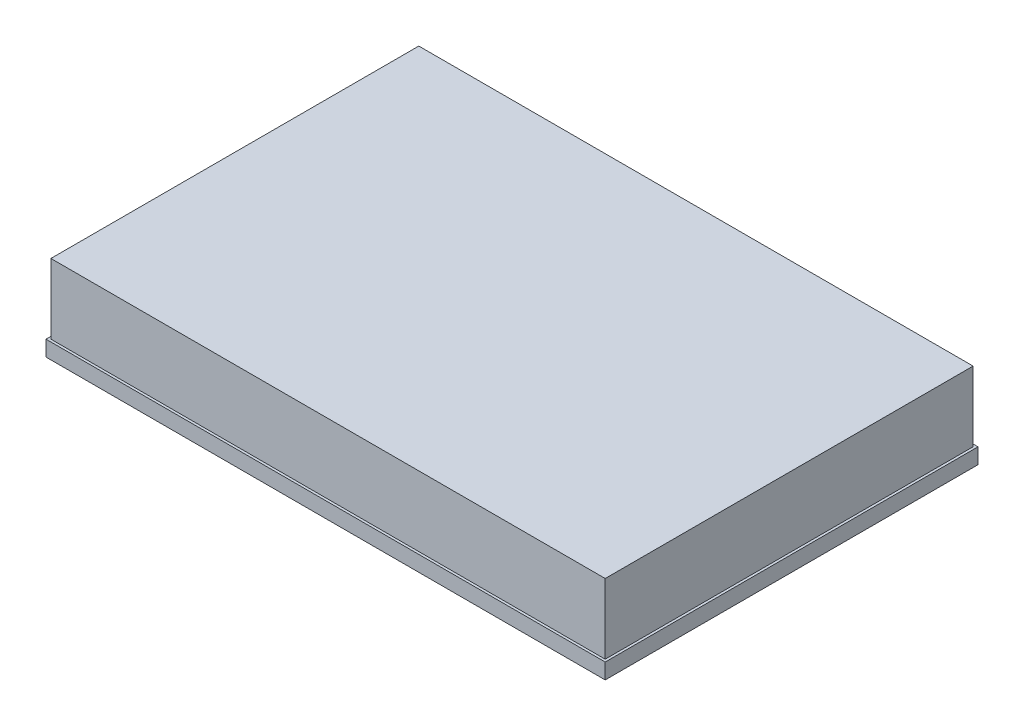
ISO-10303-21;
HEADER;
FILE_DESCRIPTION(('STEP AP214'),'2;1');
FILE_NAME('part.step','',(''),(''),'','','');
FILE_SCHEMA(('AUTOMOTIVE_DESIGN { 1 0 10303 214 1 1 1 1 }'));
ENDSEC;
DATA;
#1=APPLICATION_CONTEXT('core data for automotive mechanical design processes');
#2=APPLICATION_PROTOCOL_DEFINITION('international standard','automotive_design',2000,#1);
#3=PRODUCT_CONTEXT('',#1,'mechanical');
#4=PRODUCT('Part','Part','',(#3));
#5=PRODUCT_RELATED_PRODUCT_CATEGORY('part','',(#4));
#6=PRODUCT_DEFINITION_FORMATION('','',#4);
#7=PRODUCT_DEFINITION_CONTEXT('part definition',#1,'design');
#8=PRODUCT_DEFINITION('design','',#6,#7);
#9=PRODUCT_DEFINITION_SHAPE('','',#8);
#10=(LENGTH_UNIT() NAMED_UNIT(*) SI_UNIT(.MILLI.,.METRE.));
#11=(NAMED_UNIT(*) PLANE_ANGLE_UNIT() SI_UNIT($,.RADIAN.));
#12=(NAMED_UNIT(*) SI_UNIT($,.STERADIAN.) SOLID_ANGLE_UNIT());
#13=UNCERTAINTY_MEASURE_WITH_UNIT(LENGTH_MEASURE(1.E-05),#10,'distance_accuracy_value','');
#14=(GEOMETRIC_REPRESENTATION_CONTEXT(3) GLOBAL_UNCERTAINTY_ASSIGNED_CONTEXT((#13)) GLOBAL_UNIT_ASSIGNED_CONTEXT((#10,
#11,#12)) REPRESENTATION_CONTEXT('',''));
#15=CARTESIAN_POINT('',(0.,0.,0.));
#16=DIRECTION('',(0.,0.,1.));
#17=DIRECTION('',(1.,0.,0.));
#18=AXIS2_PLACEMENT_3D('',#15,#16,#17);
#19=CARTESIAN_POINT('',(0.,3.175,0.));
#20=DIRECTION('',(0.,1.,0.));
#21=DIRECTION('',(0.,0.,1.));
#22=AXIS2_PLACEMENT_3D('',#19,#20,#21);
#23=PLANE('',#22);
#24=DIRECTION('',(0.,0.,-1.));
#25=VECTOR('',#24,1.);
#26=CARTESIAN_POINT('',(0.,3.175,0.));
#27=LINE('',#26,#25);
#28=CARTESIAN_POINT('',(0.,3.175,0.));
#29=VERTEX_POINT('',#28);
#30=CARTESIAN_POINT('',(0.,3.175,-76.2));
#31=VERTEX_POINT('',#30);
#32=EDGE_CURVE('E149',#29,#31,#27,.T.);
#33=ORIENTED_EDGE('',*,*,#32,.T.);
#34=DIRECTION('',(-1.,0.,0.));
#35=VECTOR('',#34,1.);
#36=CARTESIAN_POINT('',(0.,3.175,-76.2));
#37=LINE('',#36,#35);
#38=CARTESIAN_POINT('',(-114.3,3.175,-76.2));
#39=VERTEX_POINT('',#38);
#40=EDGE_CURVE('E87',#31,#39,#37,.T.);
#41=ORIENTED_EDGE('',*,*,#40,.T.);
#42=DIRECTION('',(0.,0.,1.));
#43=VECTOR('',#42,1.);
#44=CARTESIAN_POINT('',(-114.3,3.175,0.));
#45=LINE('',#44,#43);
#46=CARTESIAN_POINT('',(-114.3,3.175,0.));
#47=VERTEX_POINT('',#46);
#48=EDGE_CURVE('E152',#39,#47,#45,.T.);
#49=ORIENTED_EDGE('',*,*,#48,.T.);
#50=DIRECTION('',(1.,0.,0.));
#51=VECTOR('',#50,1.);
#52=CARTESIAN_POINT('',(0.,3.175,0.));
#53=LINE('',#52,#51);
#54=EDGE_CURVE('E59',#47,#29,#53,.T.);
#55=ORIENTED_EDGE('',*,*,#54,.T.);
#56=EDGE_LOOP('',(#33,#41,#49,#55));
#57=FACE_BOUND('',#56,.T.);
#58=DIRECTION('',(-1.,0.,0.));
#59=VECTOR('',#58,1.);
#60=CARTESIAN_POINT('',(-0.5,3.175,-75.7));
#61=LINE('',#60,#59);
#62=CARTESIAN_POINT('',(-0.5,3.175,-75.7));
#63=VERTEX_POINT('',#62);
#64=CARTESIAN_POINT('',(-113.8,3.175,-75.7));
#65=VERTEX_POINT('',#64);
#66=EDGE_CURVE('E141',#63,#65,#61,.T.);
#67=ORIENTED_EDGE('',*,*,#66,.F.);
#68=DIRECTION('',(0.,0.,-1.));
#69=VECTOR('',#68,1.);
#70=CARTESIAN_POINT('',(-0.5,3.175,-14.0346711477281));
#71=LINE('',#70,#69);
#72=CARTESIAN_POINT('',(-0.5,3.175,-0.5));
#73=VERTEX_POINT('',#72);
#74=EDGE_CURVE('E125',#73,#63,#71,.T.);
#75=ORIENTED_EDGE('',*,*,#74,.F.);
#76=DIRECTION('',(1.,0.,0.));
#77=VECTOR('',#76,1.);
#78=CARTESIAN_POINT('',(-113.8,3.175,-0.5));
#79=LINE('',#78,#77);
#80=CARTESIAN_POINT('',(-113.8,3.175,-0.5));
#81=VERTEX_POINT('',#80);
#82=EDGE_CURVE('E119',#81,#73,#79,.T.);
#83=ORIENTED_EDGE('',*,*,#82,.F.);
#84=DIRECTION('',(0.,0.,1.));
#85=VECTOR('',#84,1.);
#86=CARTESIAN_POINT('',(-113.8,3.175,-75.7));
#87=LINE('',#86,#85);
#88=EDGE_CURVE('E143',#65,#81,#87,.T.);
#89=ORIENTED_EDGE('',*,*,#88,.F.);
#90=EDGE_LOOP('',(#67,#75,#83,#89));
#91=FACE_BOUND('',#90,.T.);
#92=ADVANCED_FACE('F35',(#57,#91),#23,.T.);
#93=CARTESIAN_POINT('',(0.,3.175,0.));
#94=DIRECTION('',(-1.,0.,0.));
#95=DIRECTION('',(0.,0.,1.));
#96=AXIS2_PLACEMENT_3D('',#93,#94,#95);
#97=PLANE('',#96);
#98=DIRECTION('',(0.,0.,-1.));
#99=VECTOR('',#98,1.);
#100=CARTESIAN_POINT('',(0.,0.,0.));
#101=LINE('',#100,#99);
#102=CARTESIAN_POINT('',(0.,0.,0.));
#103=VERTEX_POINT('',#102);
#104=CARTESIAN_POINT('',(0.,0.,-76.2));
#105=VERTEX_POINT('',#104);
#106=EDGE_CURVE('E128',#103,#105,#101,.T.);
#107=ORIENTED_EDGE('',*,*,#106,.T.);
#108=DIRECTION('',(0.,-1.,0.));
#109=VECTOR('',#108,1.);
#110=CARTESIAN_POINT('',(0.,3.175,-76.2));
#111=LINE('',#110,#109);
#112=EDGE_CURVE('E11',#31,#105,#111,.T.);
#113=ORIENTED_EDGE('',*,*,#112,.F.);
#114=ORIENTED_EDGE('',*,*,#32,.F.);
#115=DIRECTION('',(0.,-1.,0.));
#116=VECTOR('',#115,1.);
#117=CARTESIAN_POINT('',(0.,3.175,0.));
#118=LINE('',#117,#116);
#119=EDGE_CURVE('E155',#29,#103,#118,.T.);
#120=ORIENTED_EDGE('',*,*,#119,.T.);
#121=EDGE_LOOP('',(#107,#113,#114,#120));
#122=FACE_BOUND('',#121,.T.);
#123=ADVANCED_FACE('F37',(#122),#97,.F.);
#124=CARTESIAN_POINT('',(0.,3.175,-76.2));
#125=DIRECTION('',(0.,0.,1.));
#126=DIRECTION('',(1.,0.,0.));
#127=AXIS2_PLACEMENT_3D('',#124,#125,#126);
#128=PLANE('',#127);
#129=DIRECTION('',(-1.,0.,0.));
#130=VECTOR('',#129,1.);
#131=CARTESIAN_POINT('',(0.,0.,-76.2));
#132=LINE('',#131,#130);
#133=CARTESIAN_POINT('',(-114.3,0.,-76.2));
#134=VERTEX_POINT('',#133);
#135=EDGE_CURVE('E158',#105,#134,#132,.T.);
#136=ORIENTED_EDGE('',*,*,#135,.T.);
#137=DIRECTION('',(0.,-1.,0.));
#138=VECTOR('',#137,1.);
#139=CARTESIAN_POINT('',(-114.3,3.175,-76.2));
#140=LINE('',#139,#138);
#141=EDGE_CURVE('E43',#39,#134,#140,.T.);
#142=ORIENTED_EDGE('',*,*,#141,.F.);
#143=ORIENTED_EDGE('',*,*,#40,.F.);
#144=ORIENTED_EDGE('',*,*,#112,.T.);
#145=EDGE_LOOP('',(#136,#142,#143,#144));
#146=FACE_BOUND('',#145,.T.);
#147=ADVANCED_FACE('F185',(#146),#128,.F.);
#148=CARTESIAN_POINT('',(-114.3,3.175,0.));
#149=DIRECTION('',(1.,0.,0.));
#150=DIRECTION('',(0.,0.,-1.));
#151=AXIS2_PLACEMENT_3D('',#148,#149,#150);
#152=PLANE('',#151);
#153=DIRECTION('',(0.,0.,1.));
#154=VECTOR('',#153,1.);
#155=CARTESIAN_POINT('',(-114.3,0.,0.));
#156=LINE('',#155,#154);
#157=CARTESIAN_POINT('',(-114.3,0.,0.));
#158=VERTEX_POINT('',#157);
#159=EDGE_CURVE('E160',#134,#158,#156,.T.);
#160=ORIENTED_EDGE('',*,*,#159,.T.);
#161=DIRECTION('',(0.,-1.,0.));
#162=VECTOR('',#161,1.);
#163=CARTESIAN_POINT('',(-114.3,3.175,0.));
#164=LINE('',#163,#162);
#165=EDGE_CURVE('E164',#47,#158,#164,.T.);
#166=ORIENTED_EDGE('',*,*,#165,.F.);
#167=ORIENTED_EDGE('',*,*,#48,.F.);
#168=ORIENTED_EDGE('',*,*,#141,.T.);
#169=EDGE_LOOP('',(#160,#166,#167,#168));
#170=FACE_BOUND('',#169,.T.);
#171=ADVANCED_FACE('F169',(#170),#152,.F.);
#172=CARTESIAN_POINT('',(0.,3.175,0.));
#173=DIRECTION('',(0.,0.,-1.));
#174=DIRECTION('',(-1.,0.,0.));
#175=AXIS2_PLACEMENT_3D('',#172,#173,#174);
#176=PLANE('',#175);
#177=DIRECTION('',(1.,0.,0.));
#178=VECTOR('',#177,1.);
#179=CARTESIAN_POINT('',(0.,0.,0.));
#180=LINE('',#179,#178);
#181=EDGE_CURVE('E80',#158,#103,#180,.T.);
#182=ORIENTED_EDGE('',*,*,#181,.T.);
#183=ORIENTED_EDGE('',*,*,#119,.F.);
#184=ORIENTED_EDGE('',*,*,#54,.F.);
#185=ORIENTED_EDGE('',*,*,#165,.T.);
#186=EDGE_LOOP('',(#182,#183,#184,#185));
#187=FACE_BOUND('',#186,.T.);
#188=ADVANCED_FACE('F177',(#187),#176,.F.);
#189=CARTESIAN_POINT('',(0.,0.,0.));
#190=DIRECTION('',(0.,1.,0.));
#191=DIRECTION('',(0.,0.,1.));
#192=AXIS2_PLACEMENT_3D('',#189,#190,#191);
#193=PLANE('',#192);
#194=ORIENTED_EDGE('',*,*,#106,.F.);
#195=ORIENTED_EDGE('',*,*,#181,.F.);
#196=ORIENTED_EDGE('',*,*,#159,.F.);
#197=ORIENTED_EDGE('',*,*,#135,.F.);
#198=EDGE_LOOP('',(#194,#195,#196,#197));
#199=FACE_BOUND('',#198,.T.);
#200=ADVANCED_FACE('F173',(#199),#193,.F.);
#201=CARTESIAN_POINT('',(-0.5,17.4625,-14.0346711477281));
#202=DIRECTION('',(-1.,0.,0.));
#203=DIRECTION('',(0.,0.,1.));
#204=AXIS2_PLACEMENT_3D('',#201,#202,#203);
#205=PLANE('',#204);
#206=ORIENTED_EDGE('',*,*,#74,.T.);
#207=DIRECTION('',(0.,-1.,0.));
#208=VECTOR('',#207,1.);
#209=CARTESIAN_POINT('',(-0.5,17.4625,-75.7));
#210=LINE('',#209,#208);
#211=CARTESIAN_POINT('',(-0.5,17.4625,-75.7));
#212=VERTEX_POINT('',#211);
#213=EDGE_CURVE('E122',#212,#63,#210,.T.);
#214=ORIENTED_EDGE('',*,*,#213,.F.);
#215=DIRECTION('',(0.,0.,-1.));
#216=VECTOR('',#215,1.);
#217=CARTESIAN_POINT('',(-0.5,17.4625,-0.5));
#218=LINE('',#217,#216);
#219=CARTESIAN_POINT('',(-0.5,17.4625,-0.5));
#220=VERTEX_POINT('',#219);
#221=EDGE_CURVE('E109',#220,#212,#218,.T.);
#222=ORIENTED_EDGE('',*,*,#221,.F.);
#223=DIRECTION('',(0.,-1.,0.));
#224=VECTOR('',#223,1.);
#225=CARTESIAN_POINT('',(-0.5,17.4625,-0.5));
#226=LINE('',#225,#224);
#227=EDGE_CURVE('E139',#220,#73,#226,.T.);
#228=ORIENTED_EDGE('',*,*,#227,.T.);
#229=EDGE_LOOP('',(#206,#214,#222,#228));
#230=FACE_BOUND('',#229,.T.);
#231=ADVANCED_FACE('F123',(#230),#205,.F.);
#232=CARTESIAN_POINT('',(-0.5,17.4625,-75.7));
#233=DIRECTION('',(0.,0.,1.));
#234=DIRECTION('',(1.,0.,0.));
#235=AXIS2_PLACEMENT_3D('',#232,#233,#234);
#236=PLANE('',#235);
#237=ORIENTED_EDGE('',*,*,#66,.T.);
#238=DIRECTION('',(0.,-1.,0.));
#239=VECTOR('',#238,1.);
#240=CARTESIAN_POINT('',(-113.8,17.4625,-75.7));
#241=LINE('',#240,#239);
#242=CARTESIAN_POINT('',(-113.8,17.4625,-75.7));
#243=VERTEX_POINT('',#242);
#244=EDGE_CURVE('E129',#243,#65,#241,.T.);
#245=ORIENTED_EDGE('',*,*,#244,.F.);
#246=DIRECTION('',(-1.,0.,0.));
#247=VECTOR('',#246,1.);
#248=CARTESIAN_POINT('',(-0.5,17.4625,-75.7));
#249=LINE('',#248,#247);
#250=EDGE_CURVE('E113',#212,#243,#249,.T.);
#251=ORIENTED_EDGE('',*,*,#250,.F.);
#252=ORIENTED_EDGE('',*,*,#213,.T.);
#253=EDGE_LOOP('',(#237,#245,#251,#252));
#254=FACE_BOUND('',#253,.T.);
#255=ADVANCED_FACE('F131',(#254),#236,.F.);
#256=CARTESIAN_POINT('',(-113.8,17.4625,-75.7));
#257=DIRECTION('',(1.,0.,0.));
#258=DIRECTION('',(0.,0.,-1.));
#259=AXIS2_PLACEMENT_3D('',#256,#257,#258);
#260=PLANE('',#259);
#261=ORIENTED_EDGE('',*,*,#88,.T.);
#262=DIRECTION('',(0.,-1.,0.));
#263=VECTOR('',#262,1.);
#264=CARTESIAN_POINT('',(-113.8,17.4625,-0.5));
#265=LINE('',#264,#263);
#266=CARTESIAN_POINT('',(-113.8,17.4625,-0.5));
#267=VERTEX_POINT('',#266);
#268=EDGE_CURVE('E50',#267,#81,#265,.T.);
#269=ORIENTED_EDGE('',*,*,#268,.F.);
#270=DIRECTION('',(0.,0.,1.));
#271=VECTOR('',#270,1.);
#272=CARTESIAN_POINT('',(-113.8,17.4625,-75.7));
#273=LINE('',#272,#271);
#274=EDGE_CURVE('E134',#243,#267,#273,.T.);
#275=ORIENTED_EDGE('',*,*,#274,.F.);
#276=ORIENTED_EDGE('',*,*,#244,.T.);
#277=EDGE_LOOP('',(#261,#269,#275,#276));
#278=FACE_BOUND('',#277,.T.);
#279=ADVANCED_FACE('F198',(#278),#260,.F.);
#280=CARTESIAN_POINT('',(-113.8,17.4625,-0.5));
#281=DIRECTION('',(0.,0.,-1.));
#282=DIRECTION('',(-1.,0.,0.));
#283=AXIS2_PLACEMENT_3D('',#280,#281,#282);
#284=PLANE('',#283);
#285=ORIENTED_EDGE('',*,*,#82,.T.);
#286=ORIENTED_EDGE('',*,*,#227,.F.);
#287=DIRECTION('',(1.,0.,0.));
#288=VECTOR('',#287,1.);
#289=CARTESIAN_POINT('',(-113.8,17.4625,-0.5));
#290=LINE('',#289,#288);
#291=EDGE_CURVE('E115',#267,#220,#290,.T.);
#292=ORIENTED_EDGE('',*,*,#291,.F.);
#293=ORIENTED_EDGE('',*,*,#268,.T.);
#294=EDGE_LOOP('',(#285,#286,#292,#293));
#295=FACE_BOUND('',#294,.T.);
#296=ADVANCED_FACE('F201',(#295),#284,.F.);
#297=CARTESIAN_POINT('',(0.,17.4625,0.));
#298=DIRECTION('',(0.,1.,0.));
#299=DIRECTION('',(0.,0.,1.));
#300=AXIS2_PLACEMENT_3D('',#297,#298,#299);
#301=PLANE('',#300);
#302=ORIENTED_EDGE('',*,*,#221,.T.);
#303=ORIENTED_EDGE('',*,*,#250,.T.);
#304=ORIENTED_EDGE('',*,*,#274,.T.);
#305=ORIENTED_EDGE('',*,*,#291,.T.);
#306=EDGE_LOOP('',(#302,#303,#304,#305));
#307=FACE_BOUND('',#306,.T.);
#308=ADVANCED_FACE('F111',(#307),#301,.T.);
#309=CLOSED_SHELL('',(#92,#123,#147,#171,#188,#200,#231,#255,#279,#296,#308));
#310=MANIFOLD_SOLID_BREP('B2',#309);
#311=ADVANCED_BREP_SHAPE_REPRESENTATION('',(#18,#310),#14);
#312=SHAPE_DEFINITION_REPRESENTATION(#9,#311);
ENDSEC;
END-ISO-10303-21;
